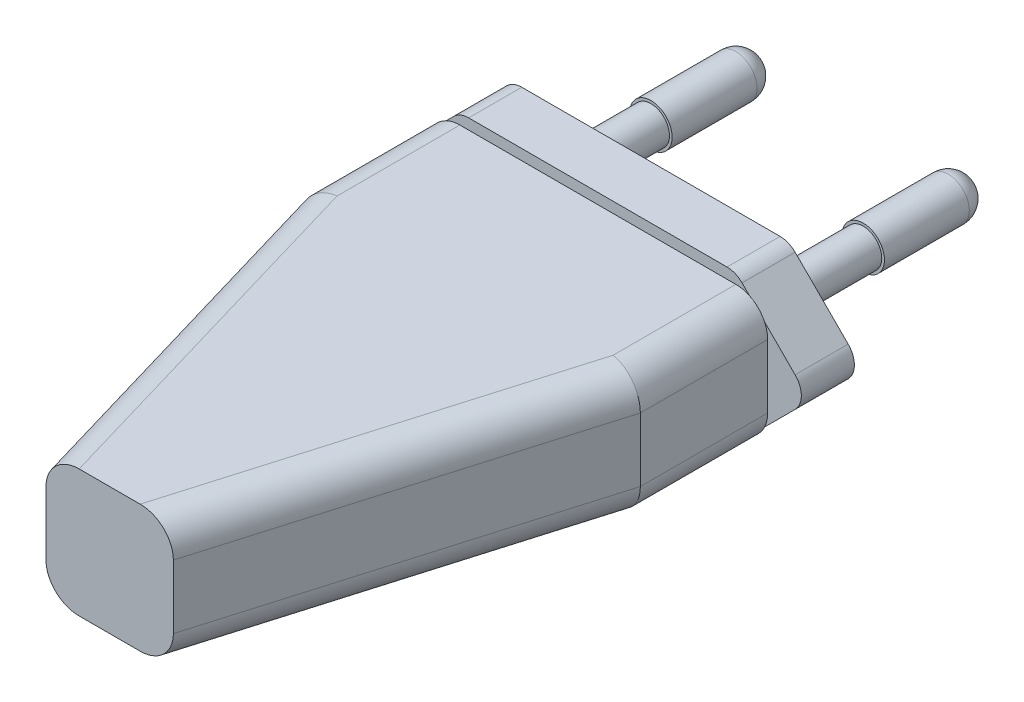
ISO-10303-21;
HEADER;
FILE_DESCRIPTION(('STEP AP214'),'2;1');
FILE_NAME('part.step','',(''),(''),'','','');
FILE_SCHEMA(('AUTOMOTIVE_DESIGN { 1 0 10303 214 1 1 1 1 }'));
ENDSEC;
DATA;
#1=APPLICATION_CONTEXT('core data for automotive mechanical design processes');
#2=APPLICATION_PROTOCOL_DEFINITION('international standard','automotive_design',2000,#1);
#3=PRODUCT_CONTEXT('',#1,'mechanical');
#4=PRODUCT('Part','Part','',(#3));
#5=PRODUCT_RELATED_PRODUCT_CATEGORY('part','',(#4));
#6=PRODUCT_DEFINITION_FORMATION('','',#4);
#7=PRODUCT_DEFINITION_CONTEXT('part definition',#1,'design');
#8=PRODUCT_DEFINITION('design','',#6,#7);
#9=PRODUCT_DEFINITION_SHAPE('','',#8);
#10=(LENGTH_UNIT() NAMED_UNIT(*) SI_UNIT(.MILLI.,.METRE.));
#11=(NAMED_UNIT(*) PLANE_ANGLE_UNIT() SI_UNIT($,.RADIAN.));
#12=(NAMED_UNIT(*) SI_UNIT($,.STERADIAN.) SOLID_ANGLE_UNIT());
#13=UNCERTAINTY_MEASURE_WITH_UNIT(LENGTH_MEASURE(1.E-05),#10,'distance_accuracy_value','');
#14=(GEOMETRIC_REPRESENTATION_CONTEXT(3) GLOBAL_UNCERTAINTY_ASSIGNED_CONTEXT((#13)) GLOBAL_UNIT_ASSIGNED_CONTEXT((#10,
#11,#12)) REPRESENTATION_CONTEXT('',''));
#15=CARTESIAN_POINT('',(0.,0.,0.));
#16=DIRECTION('',(0.,0.,1.));
#17=DIRECTION('',(1.,0.,0.));
#18=AXIS2_PLACEMENT_3D('',#15,#16,#17);
#19=CARTESIAN_POINT('',(16.,12.,-46.));
#20=DIRECTION('',(0.,0.,1.));
#21=DIRECTION('',(1.,0.,0.));
#22=AXIS2_PLACEMENT_3D('',#19,#20,#21);
#23=PLANE('',#22);
#24=DIRECTION('',(0.707106781186547,-0.707106781186548,0.));
#25=VECTOR('',#24,1.);
#26=CARTESIAN_POINT('',(20.,6.,-46.));
#27=LINE('',#26,#25);
#28=CARTESIAN_POINT('',(14.2928932188135,11.7071067811865,-46.));
#29=VERTEX_POINT('',#28);
#30=CARTESIAN_POINT('',(15.7071067811866,10.2928932188134,-46.));
#31=VERTEX_POINT('',#30);
#32=EDGE_CURVE('E371',#29,#31,#27,.T.);
#33=ORIENTED_EDGE('',*,*,#32,.F.);
#34=CARTESIAN_POINT('',(13.,9.,-46.));
#35=DIRECTION('',(0.,0.,1.));
#36=DIRECTION('',(1.,0.,0.));
#37=AXIS2_PLACEMENT_3D('',#34,#35,#36);
#38=CIRCLE('',#37,3.);
#39=EDGE_CURVE('E330',#29,#31,#38,.F.);
#40=ORIENTED_EDGE('',*,*,#39,.T.);
#41=EDGE_LOOP('',(#33,#40));
#42=FACE_BOUND('',#41,.T.);
#43=ADVANCED_FACE('F33',(#42),#23,.F.);
#44=DIRECTION('',(0.707106781186547,0.707106781186548,0.));
#45=VECTOR('',#44,1.);
#46=CARTESIAN_POINT('',(-13.,13.,-46.));
#47=LINE('',#46,#45);
#48=CARTESIAN_POINT('',(-15.7071067811865,10.2928932188134,-46.));
#49=VERTEX_POINT('',#48);
#50=CARTESIAN_POINT('',(-14.2928932188134,11.7071067811865,-46.));
#51=VERTEX_POINT('',#50);
#52=EDGE_CURVE('E255',#49,#51,#47,.T.);
#53=ORIENTED_EDGE('',*,*,#52,.F.);
#54=CARTESIAN_POINT('',(-13.,9.,-46.));
#55=DIRECTION('',(0.,0.,1.));
#56=DIRECTION('',(1.,0.,0.));
#57=AXIS2_PLACEMENT_3D('',#54,#55,#56);
#58=CIRCLE('',#57,3.);
#59=EDGE_CURVE('E337',#49,#51,#58,.F.);
#60=ORIENTED_EDGE('',*,*,#59,.T.);
#61=EDGE_LOOP('',(#53,#60));
#62=FACE_BOUND('',#61,.T.);
#63=ADVANCED_FACE('F442',(#62),#23,.F.);
#64=DIRECTION('',(-0.707106781186547,0.707106781186548,0.));
#65=VECTOR('',#64,1.);
#66=CARTESIAN_POINT('',(-20.,6.,-46.));
#67=LINE('',#66,#65);
#68=CARTESIAN_POINT('',(-14.2928932188134,0.292893218813449,-46.));
#69=VERTEX_POINT('',#68);
#70=CARTESIAN_POINT('',(-15.7071067811865,1.70710678118655,-46.));
#71=VERTEX_POINT('',#70);
#72=EDGE_CURVE('E252',#69,#71,#67,.T.);
#73=ORIENTED_EDGE('',*,*,#72,.F.);
#74=CARTESIAN_POINT('',(-13.,3.,-46.));
#75=DIRECTION('',(0.,0.,1.));
#76=DIRECTION('',(1.,0.,0.));
#77=AXIS2_PLACEMENT_3D('',#74,#75,#76);
#78=CIRCLE('',#77,3.);
#79=EDGE_CURVE('E342',#69,#71,#78,.F.);
#80=ORIENTED_EDGE('',*,*,#79,.T.);
#81=EDGE_LOOP('',(#73,#80));
#82=FACE_BOUND('',#81,.T.);
#83=ADVANCED_FACE('F448',(#82),#23,.F.);
#84=DIRECTION('',(-0.707106781186547,-0.707106781186547,0.));
#85=VECTOR('',#84,1.);
#86=CARTESIAN_POINT('',(13.,-1.,-46.));
#87=LINE('',#86,#85);
#88=CARTESIAN_POINT('',(15.7071067811866,1.70710678118655,-46.));
#89=VERTEX_POINT('',#88);
#90=CARTESIAN_POINT('',(14.2928932188135,0.292893218813449,-46.));
#91=VERTEX_POINT('',#90);
#92=EDGE_CURVE('E223',#89,#91,#87,.T.);
#93=ORIENTED_EDGE('',*,*,#92,.F.);
#94=CARTESIAN_POINT('',(13.,3.,-46.));
#95=DIRECTION('',(0.,0.,1.));
#96=DIRECTION('',(1.,0.,0.));
#97=AXIS2_PLACEMENT_3D('',#94,#95,#96);
#98=CIRCLE('',#97,3.);
#99=EDGE_CURVE('E219',#89,#91,#98,.F.);
#100=ORIENTED_EDGE('',*,*,#99,.T.);
#101=EDGE_LOOP('',(#93,#100));
#102=FACE_BOUND('',#101,.T.);
#103=ADVANCED_FACE('F221',(#102),#23,.F.);
#104=CARTESIAN_POINT('',(-6.,12.,0.));
#105=DIRECTION('',(0.,0.,-1.));
#106=DIRECTION('',(-1.,0.,0.));
#107=AXIS2_PLACEMENT_3D('',#104,#105,#106);
#108=PLANE('',#107);
#109=DIRECTION('',(0.,-1.,0.));
#110=VECTOR('',#109,1.);
#111=CARTESIAN_POINT('',(-6.,12.,0.));
#112=LINE('',#111,#110);
#113=CARTESIAN_POINT('',(-6.,9.,0.));
#114=VERTEX_POINT('',#113);
#115=CARTESIAN_POINT('',(-6.,3.,0.));
#116=VERTEX_POINT('',#115);
#117=EDGE_CURVE('E301',#114,#116,#112,.T.);
#118=ORIENTED_EDGE('',*,*,#117,.T.);
#119=CARTESIAN_POINT('',(-2.8729332094113,3.,0.));
#120=DIRECTION('',(0.,0.,-1.));
#121=DIRECTION('',(1.,0.,0.));
#122=AXIS2_PLACEMENT_3D('',#119,#120,#121);
#123=ELLIPSE('',#122,3.12706679058871,3.);
#124=CARTESIAN_POINT('',(-2.8729332094113,0.,0.));
#125=VERTEX_POINT('',#124);
#126=EDGE_CURVE('E315',#116,#125,#123,.F.);
#127=ORIENTED_EDGE('',*,*,#126,.T.);
#128=DIRECTION('',(1.,0.,0.));
#129=VECTOR('',#128,1.);
#130=CARTESIAN_POINT('',(-6.,0.,0.));
#131=LINE('',#130,#129);
#132=CARTESIAN_POINT('',(2.8729332094113,0.,0.));
#133=VERTEX_POINT('',#132);
#134=EDGE_CURVE('E283',#125,#133,#131,.T.);
#135=ORIENTED_EDGE('',*,*,#134,.T.);
#136=CARTESIAN_POINT('',(2.8729332094113,3.,0.));
#137=DIRECTION('',(0.,0.,-1.));
#138=DIRECTION('',(1.,0.,0.));
#139=AXIS2_PLACEMENT_3D('',#136,#137,#138);
#140=ELLIPSE('',#139,3.12706679058871,3.);
#141=CARTESIAN_POINT('',(6.,3.,0.));
#142=VERTEX_POINT('',#141);
#143=EDGE_CURVE('E311',#133,#142,#140,.F.);
#144=ORIENTED_EDGE('',*,*,#143,.T.);
#145=DIRECTION('',(0.,-1.,0.));
#146=VECTOR('',#145,1.);
#147=CARTESIAN_POINT('',(6.,12.,0.));
#148=LINE('',#147,#146);
#149=CARTESIAN_POINT('',(6.,9.,0.));
#150=VERTEX_POINT('',#149);
#151=EDGE_CURVE('E298',#150,#142,#148,.T.);
#152=ORIENTED_EDGE('',*,*,#151,.F.);
#153=CARTESIAN_POINT('',(2.8729332094113,9.,0.));
#154=DIRECTION('',(0.,0.,-1.));
#155=DIRECTION('',(-1.,0.,0.));
#156=AXIS2_PLACEMENT_3D('',#153,#154,#155);
#157=ELLIPSE('',#156,3.12706679058871,3.);
#158=CARTESIAN_POINT('',(2.8729332094113,12.,0.));
#159=VERTEX_POINT('',#158);
#160=EDGE_CURVE('E309',#150,#159,#157,.F.);
#161=ORIENTED_EDGE('',*,*,#160,.T.);
#162=DIRECTION('',(1.,0.,0.));
#163=VECTOR('',#162,1.);
#164=CARTESIAN_POINT('',(-6.,12.,0.));
#165=LINE('',#164,#163);
#166=CARTESIAN_POINT('',(-2.8729332094113,12.,0.));
#167=VERTEX_POINT('',#166);
#168=EDGE_CURVE('E276',#167,#159,#165,.T.);
#169=ORIENTED_EDGE('',*,*,#168,.F.);
#170=CARTESIAN_POINT('',(-2.8729332094113,9.,0.));
#171=DIRECTION('',(0.,0.,-1.));
#172=DIRECTION('',(-1.,0.,0.));
#173=AXIS2_PLACEMENT_3D('',#170,#171,#172);
#174=ELLIPSE('',#173,3.12706679058871,3.);
#175=EDGE_CURVE('E313',#167,#114,#174,.F.);
#176=ORIENTED_EDGE('',*,*,#175,.T.);
#177=EDGE_LOOP('',(#118,#127,#135,#144,#152,#161,#169,#176));
#178=FACE_BOUND('',#177,.T.);
#179=ADVANCED_FACE('F454',(#178),#108,.F.);
#180=CARTESIAN_POINT('',(11.,12.,-17.));
#181=DIRECTION('',(-0.95936550157127,0.,-0.28216632399155));
#182=DIRECTION('',(-0.28216632399155,0.,0.959365501571271));
#183=AXIS2_PLACEMENT_3D('',#180,#181,#182);
#184=PLANE('',#183);
#185=ORIENTED_EDGE('',*,*,#151,.T.);
#186=DIRECTION('',(0.28216632399155,0.,-0.959365501571271));
#187=VECTOR('',#186,1.);
#188=CARTESIAN_POINT('',(11.,3.,-17.));
#189=LINE('',#188,#187);
#190=CARTESIAN_POINT('',(16.,3.,-34.));
#191=VERTEX_POINT('',#190);
#192=EDGE_CURVE('E354',#142,#191,#189,.T.);
#193=ORIENTED_EDGE('',*,*,#192,.T.);
#194=DIRECTION('',(0.,-1.,0.));
#195=VECTOR('',#194,1.);
#196=CARTESIAN_POINT('',(16.,12.,-34.));
#197=LINE('',#196,#195);
#198=CARTESIAN_POINT('',(16.,9.,-34.));
#199=VERTEX_POINT('',#198);
#200=EDGE_CURVE('E295',#199,#191,#197,.T.);
#201=ORIENTED_EDGE('',*,*,#200,.F.);
#202=DIRECTION('',(0.28216632399155,0.,-0.959365501571271));
#203=VECTOR('',#202,1.);
#204=CARTESIAN_POINT('',(6.00000000000001,9.,0.));
#205=LINE('',#204,#203);
#206=EDGE_CURVE('E352',#199,#150,#205,.F.);
#207=ORIENTED_EDGE('',*,*,#206,.T.);
#208=EDGE_LOOP('',(#185,#193,#201,#207));
#209=FACE_BOUND('',#208,.T.);
#210=ADVANCED_FACE('F459',(#209),#184,.F.);
#211=CARTESIAN_POINT('',(16.,12.,-34.));
#212=DIRECTION('',(-1.,0.,0.));
#213=DIRECTION('',(0.,0.,1.));
#214=AXIS2_PLACEMENT_3D('',#211,#212,#213);
#215=PLANE('',#214);
#216=ORIENTED_EDGE('',*,*,#200,.T.);
#217=DIRECTION('',(0.,0.,-1.));
#218=VECTOR('',#217,1.);
#219=CARTESIAN_POINT('',(16.,3.,-34.));
#220=LINE('',#219,#218);
#221=CARTESIAN_POINT('',(16.,3.,-46.));
#222=VERTEX_POINT('',#221);
#223=EDGE_CURVE('E253',#191,#222,#220,.T.);
#224=ORIENTED_EDGE('',*,*,#223,.T.);
#225=DIRECTION('',(0.,-1.,0.));
#226=VECTOR('',#225,1.);
#227=CARTESIAN_POINT('',(16.,12.,-46.));
#228=LINE('',#227,#226);
#229=CARTESIAN_POINT('',(16.,9.,-46.));
#230=VERTEX_POINT('',#229);
#231=EDGE_CURVE('E292',#230,#222,#228,.T.);
#232=ORIENTED_EDGE('',*,*,#231,.F.);
#233=DIRECTION('',(0.,0.,-1.));
#234=VECTOR('',#233,1.);
#235=CARTESIAN_POINT('',(16.,9.,-34.));
#236=LINE('',#235,#234);
#237=EDGE_CURVE('E259',#230,#199,#236,.F.);
#238=ORIENTED_EDGE('',*,*,#237,.T.);
#239=EDGE_LOOP('',(#216,#224,#232,#238));
#240=FACE_BOUND('',#239,.T.);
#241=ADVANCED_FACE('F593',(#240),#215,.F.);
#242=CARTESIAN_POINT('',(-16.,12.,-34.));
#243=DIRECTION('',(1.,0.,0.));
#244=DIRECTION('',(0.,0.,-1.));
#245=AXIS2_PLACEMENT_3D('',#242,#243,#244);
#246=PLANE('',#245);
#247=DIRECTION('',(0.,-1.,0.));
#248=VECTOR('',#247,1.);
#249=CARTESIAN_POINT('',(-16.,12.,-46.));
#250=LINE('',#249,#248);
#251=CARTESIAN_POINT('',(-16.,9.,-46.));
#252=VERTEX_POINT('',#251);
#253=CARTESIAN_POINT('',(-16.,3.,-46.));
#254=VERTEX_POINT('',#253);
#255=EDGE_CURVE('E290',#252,#254,#250,.T.);
#256=ORIENTED_EDGE('',*,*,#255,.T.);
#257=DIRECTION('',(0.,0.,1.));
#258=VECTOR('',#257,1.);
#259=CARTESIAN_POINT('',(-16.,3.,-34.));
#260=LINE('',#259,#258);
#261=CARTESIAN_POINT('',(-16.,3.,-34.));
#262=VERTEX_POINT('',#261);
#263=EDGE_CURVE('E326',#254,#262,#260,.T.);
#264=ORIENTED_EDGE('',*,*,#263,.T.);
#265=DIRECTION('',(0.,-1.,0.));
#266=VECTOR('',#265,1.);
#267=CARTESIAN_POINT('',(-16.,12.,-34.));
#268=LINE('',#267,#266);
#269=CARTESIAN_POINT('',(-16.,9.,-34.));
#270=VERTEX_POINT('',#269);
#271=EDGE_CURVE('E282',#270,#262,#268,.T.);
#272=ORIENTED_EDGE('',*,*,#271,.F.);
#273=DIRECTION('',(0.,0.,1.));
#274=VECTOR('',#273,1.);
#275=CARTESIAN_POINT('',(-16.,9.,-46.));
#276=LINE('',#275,#274);
#277=EDGE_CURVE('E324',#270,#252,#276,.F.);
#278=ORIENTED_EDGE('',*,*,#277,.T.);
#279=EDGE_LOOP('',(#256,#264,#272,#278));
#280=FACE_BOUND('',#279,.T.);
#281=ADVANCED_FACE('F498',(#280),#246,.F.);
#282=CARTESIAN_POINT('',(-11.,12.,-17.));
#283=DIRECTION('',(0.95936550157127,0.,-0.28216632399155));
#284=DIRECTION('',(-0.28216632399155,0.,-0.959365501571271));
#285=AXIS2_PLACEMENT_3D('',#282,#283,#284);
#286=PLANE('',#285);
#287=ORIENTED_EDGE('',*,*,#271,.T.);
#288=DIRECTION('',(0.28216632399155,0.,0.959365501571271));
#289=VECTOR('',#288,1.);
#290=CARTESIAN_POINT('',(-11.,3.,-17.));
#291=LINE('',#290,#289);
#292=EDGE_CURVE('E306',#262,#116,#291,.T.);
#293=ORIENTED_EDGE('',*,*,#292,.T.);
#294=ORIENTED_EDGE('',*,*,#117,.F.);
#295=DIRECTION('',(0.28216632399155,0.,0.959365501571271));
#296=VECTOR('',#295,1.);
#297=CARTESIAN_POINT('',(-16.,9.,-34.));
#298=LINE('',#297,#296);
#299=EDGE_CURVE('E304',#114,#270,#298,.F.);
#300=ORIENTED_EDGE('',*,*,#299,.T.);
#301=EDGE_LOOP('',(#287,#293,#294,#300));
#302=FACE_BOUND('',#301,.T.);
#303=ADVANCED_FACE('F487',(#302),#286,.F.);
#304=CARTESIAN_POINT('',(0.,12.,0.));
#305=DIRECTION('',(0.,1.,0.));
#306=DIRECTION('',(0.,0.,1.));
#307=AXIS2_PLACEMENT_3D('',#304,#305,#306);
#308=PLANE('',#307);
#309=DIRECTION('',(-1.,0.,0.));
#310=VECTOR('',#309,1.);
#311=CARTESIAN_POINT('',(16.,12.,-46.));
#312=LINE('',#311,#310);
#313=CARTESIAN_POINT('',(13.,12.,-46.));
#314=VERTEX_POINT('',#313);
#315=CARTESIAN_POINT('',(-13.,12.,-46.));
#316=VERTEX_POINT('',#315);
#317=EDGE_CURVE('E279',#314,#316,#312,.T.);
#318=ORIENTED_EDGE('',*,*,#317,.T.);
#319=DIRECTION('',(0.,0.,1.));
#320=VECTOR('',#319,1.);
#321=CARTESIAN_POINT('',(-13.,12.,-34.));
#322=LINE('',#321,#320);
#323=CARTESIAN_POINT('',(-13.,12.,-34.4320270880016));
#324=VERTEX_POINT('',#323);
#325=EDGE_CURVE('E349',#316,#324,#322,.T.);
#326=ORIENTED_EDGE('',*,*,#325,.T.);
#327=DIRECTION('',(0.28216632399155,0.,0.959365501571271));
#328=VECTOR('',#327,1.);
#329=CARTESIAN_POINT('',(-3.12190349528619,12.,-0.846498971974649));
#330=LINE('',#329,#328);
#331=EDGE_CURVE('E347',#324,#167,#330,.T.);
#332=ORIENTED_EDGE('',*,*,#331,.T.);
#333=ORIENTED_EDGE('',*,*,#168,.T.);
#334=DIRECTION('',(0.28216632399155,0.,-0.959365501571271));
#335=VECTOR('',#334,1.);
#336=CARTESIAN_POINT('',(13.1219034952862,12.,-34.8464989719747));
#337=LINE('',#336,#335);
#338=CARTESIAN_POINT('',(13.,12.,-34.4320270880016));
#339=VERTEX_POINT('',#338);
#340=EDGE_CURVE('E341',#159,#339,#337,.T.);
#341=ORIENTED_EDGE('',*,*,#340,.T.);
#342=DIRECTION('',(0.,0.,-1.));
#343=VECTOR('',#342,1.);
#344=CARTESIAN_POINT('',(13.,12.,-46.));
#345=LINE('',#344,#343);
#346=EDGE_CURVE('E344',#339,#314,#345,.T.);
#347=ORIENTED_EDGE('',*,*,#346,.T.);
#348=EDGE_LOOP('',(#318,#326,#332,#333,#341,#347));
#349=FACE_BOUND('',#348,.T.);
#350=ADVANCED_FACE('F585',(#349),#308,.T.);
#351=CARTESIAN_POINT('',(0.,0.,0.));
#352=DIRECTION('',(0.,1.,0.));
#353=DIRECTION('',(0.,0.,1.));
#354=AXIS2_PLACEMENT_3D('',#351,#352,#353);
#355=PLANE('',#354);
#356=ORIENTED_EDGE('',*,*,#134,.F.);
#357=DIRECTION('',(0.28216632399155,0.,0.959365501571271));
#358=VECTOR('',#357,1.);
#359=CARTESIAN_POINT('',(-2.64419648891677,0.,0.777704849681402));
#360=LINE('',#359,#358);
#361=CARTESIAN_POINT('',(-13.,0.,-34.4320270880016));
#362=VERTEX_POINT('',#361);
#363=EDGE_CURVE('E322',#125,#362,#360,.F.);
#364=ORIENTED_EDGE('',*,*,#363,.T.);
#365=DIRECTION('',(0.,0.,1.));
#366=VECTOR('',#365,1.);
#367=CARTESIAN_POINT('',(-13.,0.,0.));
#368=LINE('',#367,#366);
#369=CARTESIAN_POINT('',(-13.,0.,-46.));
#370=VERTEX_POINT('',#369);
#371=EDGE_CURVE('E320',#362,#370,#368,.F.);
#372=ORIENTED_EDGE('',*,*,#371,.T.);
#373=DIRECTION('',(-1.,0.,0.));
#374=VECTOR('',#373,1.);
#375=CARTESIAN_POINT('',(16.,0.,-46.));
#376=LINE('',#375,#374);
#377=CARTESIAN_POINT('',(13.,0.,-46.));
#378=VERTEX_POINT('',#377);
#379=EDGE_CURVE('E280',#378,#370,#376,.T.);
#380=ORIENTED_EDGE('',*,*,#379,.F.);
#381=DIRECTION('',(0.,0.,-1.));
#382=VECTOR('',#381,1.);
#383=CARTESIAN_POINT('',(13.,0.,0.));
#384=LINE('',#383,#382);
#385=CARTESIAN_POINT('',(13.,0.,-34.4320270880016));
#386=VERTEX_POINT('',#385);
#387=EDGE_CURVE('E235',#378,#386,#384,.F.);
#388=ORIENTED_EDGE('',*,*,#387,.T.);
#389=DIRECTION('',(0.28216632399155,0.,-0.959365501571271));
#390=VECTOR('',#389,1.);
#391=CARTESIAN_POINT('',(2.64419648891677,0.,0.777704849681402));
#392=LINE('',#391,#390);
#393=EDGE_CURVE('E318',#386,#133,#392,.F.);
#394=ORIENTED_EDGE('',*,*,#393,.T.);
#395=EDGE_LOOP('',(#356,#364,#372,#380,#388,#394));
#396=FACE_BOUND('',#395,.T.);
#397=ADVANCED_FACE('F478',(#396),#355,.F.);
#398=CARTESIAN_POINT('',(-13.,3.,-34.));
#399=DIRECTION('',(0.,0.,1.));
#400=DIRECTION('',(1.,0.,0.));
#401=AXIS2_PLACEMENT_3D('',#398,#399,#400);
#402=CYLINDRICAL_SURFACE('',#401,3.);
#403=EDGE_CURVE('E338',#370,#69,#78,.F.);
#404=ORIENTED_EDGE('',*,*,#403,.F.);
#405=ORIENTED_EDGE('',*,*,#371,.F.);
#406=CARTESIAN_POINT('',(-13.,3.,-34.4320270880017));
#407=DIRECTION('',(0.142538588509795,0.,0.989789245640523));
#408=DIRECTION('',(-0.989789245640523,0.,0.142538588509795));
#409=AXIS2_PLACEMENT_3D('',#406,#407,#408);
#410=ELLIPSE('',#409,3.03094826824332,3.);
#411=EDGE_CURVE('E286',#262,#362,#410,.T.);
#412=ORIENTED_EDGE('',*,*,#411,.F.);
#413=ORIENTED_EDGE('',*,*,#263,.F.);
#414=EDGE_CURVE('E336',#71,#254,#78,.F.);
#415=ORIENTED_EDGE('',*,*,#414,.F.);
#416=ORIENTED_EDGE('',*,*,#79,.F.);
#417=EDGE_LOOP('',(#404,#405,#412,#413,#415,#416));
#418=FACE_BOUND('',#417,.T.);
#419=ADVANCED_FACE('F471',(#418),#402,.T.);
#420=CARTESIAN_POINT('',(-8.12190349528619,3.,-17.8464989719747));
#421=DIRECTION('',(0.28216632399155,0.,0.959365501571271));
#422=DIRECTION('',(0.959365501571271,0.,-0.28216632399155));
#423=AXIS2_PLACEMENT_3D('',#420,#421,#422);
#424=CYLINDRICAL_SURFACE('',#423,3.);
#425=ORIENTED_EDGE('',*,*,#411,.T.);
#426=ORIENTED_EDGE('',*,*,#363,.F.);
#427=ORIENTED_EDGE('',*,*,#126,.F.);
#428=ORIENTED_EDGE('',*,*,#292,.F.);
#429=EDGE_LOOP('',(#425,#426,#427,#428));
#430=FACE_BOUND('',#429,.T.);
#431=ADVANCED_FACE('F484',(#430),#424,.T.);
#432=CARTESIAN_POINT('',(-2.64419648891677,9.,0.777704849681401));
#433=DIRECTION('',(-0.28216632399155,0.,-0.959365501571271));
#434=DIRECTION('',(-0.959365501571271,0.,0.28216632399155));
#435=AXIS2_PLACEMENT_3D('',#432,#433,#434);
#436=CYLINDRICAL_SURFACE('',#435,3.);
#437=ORIENTED_EDGE('',*,*,#175,.F.);
#438=ORIENTED_EDGE('',*,*,#331,.F.);
#439=CARTESIAN_POINT('',(-13.,9.,-34.4320270880016));
#440=DIRECTION('',(-0.142538588509795,0.,-0.989789245640523));
#441=DIRECTION('',(-0.989789245640523,0.,0.142538588509795));
#442=AXIS2_PLACEMENT_3D('',#439,#440,#441);
#443=ELLIPSE('',#442,3.03094826824332,3.);
#444=EDGE_CURVE('E360',#270,#324,#443,.T.);
#445=ORIENTED_EDGE('',*,*,#444,.F.);
#446=ORIENTED_EDGE('',*,*,#299,.F.);
#447=EDGE_LOOP('',(#437,#438,#445,#446));
#448=FACE_BOUND('',#447,.T.);
#449=ADVANCED_FACE('F494',(#448),#436,.T.);
#450=CARTESIAN_POINT('',(-13.,9.,0.));
#451=DIRECTION('',(0.,0.,-1.));
#452=DIRECTION('',(-1.,0.,0.));
#453=AXIS2_PLACEMENT_3D('',#450,#451,#452);
#454=CYLINDRICAL_SURFACE('',#453,3.);
#455=EDGE_CURVE('E333',#252,#49,#58,.F.);
#456=ORIENTED_EDGE('',*,*,#455,.F.);
#457=ORIENTED_EDGE('',*,*,#277,.F.);
#458=ORIENTED_EDGE('',*,*,#444,.T.);
#459=ORIENTED_EDGE('',*,*,#325,.F.);
#460=EDGE_CURVE('E332',#51,#316,#58,.F.);
#461=ORIENTED_EDGE('',*,*,#460,.F.);
#462=ORIENTED_EDGE('',*,*,#59,.F.);
#463=EDGE_LOOP('',(#456,#457,#458,#459,#461,#462));
#464=FACE_BOUND('',#463,.T.);
#465=ADVANCED_FACE('F501',(#464),#454,.T.);
#466=CARTESIAN_POINT('',(13.,3.,-34.));
#467=DIRECTION('',(0.,0.,-1.));
#468=DIRECTION('',(-1.,0.,0.));
#469=AXIS2_PLACEMENT_3D('',#466,#467,#468);
#470=CYLINDRICAL_SURFACE('',#469,3.);
#471=EDGE_CURVE('E227',#222,#89,#98,.F.);
#472=ORIENTED_EDGE('',*,*,#471,.F.);
#473=ORIENTED_EDGE('',*,*,#223,.F.);
#474=CARTESIAN_POINT('',(13.,3.,-34.4320270880017));
#475=DIRECTION('',(0.142538588509795,0.,-0.989789245640523));
#476=DIRECTION('',(-0.989789245640523,0.,-0.142538588509795));
#477=AXIS2_PLACEMENT_3D('',#474,#475,#476);
#478=ELLIPSE('',#477,3.03094826824332,3.);
#479=EDGE_CURVE('E362',#386,#191,#478,.F.);
#480=ORIENTED_EDGE('',*,*,#479,.F.);
#481=ORIENTED_EDGE('',*,*,#387,.F.);
#482=EDGE_CURVE('E228',#91,#378,#98,.F.);
#483=ORIENTED_EDGE('',*,*,#482,.F.);
#484=ORIENTED_EDGE('',*,*,#99,.F.);
#485=EDGE_LOOP('',(#472,#473,#480,#481,#483,#484));
#486=FACE_BOUND('',#485,.T.);
#487=ADVANCED_FACE('F233',(#486),#470,.T.);
#488=CARTESIAN_POINT('',(8.12190349528619,3.,-17.8464989719747));
#489=DIRECTION('',(0.28216632399155,0.,-0.959365501571271));
#490=DIRECTION('',(-0.959365501571271,0.,-0.28216632399155));
#491=AXIS2_PLACEMENT_3D('',#488,#489,#490);
#492=CYLINDRICAL_SURFACE('',#491,3.);
#493=ORIENTED_EDGE('',*,*,#143,.F.);
#494=ORIENTED_EDGE('',*,*,#393,.F.);
#495=ORIENTED_EDGE('',*,*,#479,.T.);
#496=ORIENTED_EDGE('',*,*,#192,.F.);
#497=EDGE_LOOP('',(#493,#494,#495,#496));
#498=FACE_BOUND('',#497,.T.);
#499=ADVANCED_FACE('F612',(#498),#492,.T.);
#500=CARTESIAN_POINT('',(2.64419648891677,9.,0.777704849681402));
#501=DIRECTION('',(-0.28216632399155,0.,0.959365501571271));
#502=DIRECTION('',(0.959365501571271,0.,0.28216632399155));
#503=AXIS2_PLACEMENT_3D('',#500,#501,#502);
#504=CYLINDRICAL_SURFACE('',#503,3.);
#505=ORIENTED_EDGE('',*,*,#160,.F.);
#506=ORIENTED_EDGE('',*,*,#206,.F.);
#507=CARTESIAN_POINT('',(13.,9.,-34.4320270880016));
#508=DIRECTION('',(-0.142538588509795,0.,0.989789245640523));
#509=DIRECTION('',(-0.989789245640523,0.,-0.142538588509795));
#510=AXIS2_PLACEMENT_3D('',#507,#508,#509);
#511=ELLIPSE('',#510,3.03094826824332,3.);
#512=EDGE_CURVE('E364',#339,#199,#511,.F.);
#513=ORIENTED_EDGE('',*,*,#512,.F.);
#514=ORIENTED_EDGE('',*,*,#340,.F.);
#515=EDGE_LOOP('',(#505,#506,#513,#514));
#516=FACE_BOUND('',#515,.T.);
#517=ADVANCED_FACE('F615',(#516),#504,.T.);
#518=CARTESIAN_POINT('',(13.,9.,0.));
#519=DIRECTION('',(0.,0.,1.));
#520=DIRECTION('',(1.,0.,0.));
#521=AXIS2_PLACEMENT_3D('',#518,#519,#520);
#522=CYLINDRICAL_SURFACE('',#521,3.);
#523=ORIENTED_EDGE('',*,*,#512,.T.);
#524=ORIENTED_EDGE('',*,*,#237,.F.);
#525=EDGE_CURVE('E328',#31,#230,#38,.F.);
#526=ORIENTED_EDGE('',*,*,#525,.F.);
#527=ORIENTED_EDGE('',*,*,#39,.F.);
#528=EDGE_CURVE('E238',#314,#29,#38,.F.);
#529=ORIENTED_EDGE('',*,*,#528,.F.);
#530=ORIENTED_EDGE('',*,*,#346,.F.);
#531=EDGE_LOOP('',(#523,#524,#526,#527,#529,#530));
#532=FACE_BOUND('',#531,.T.);
#533=ADVANCED_FACE('F619',(#532),#522,.T.);
#534=CARTESIAN_POINT('',(0.,0.,-46.));
#535=DIRECTION('',(0.,0.,1.));
#536=DIRECTION('',(1.,0.,0.));
#537=AXIS2_PLACEMENT_3D('',#534,#535,#536);
#538=PLANE('',#537);
#539=CARTESIAN_POINT('',(-18.5857864376269,7.4142135623731,-46.));
#540=VERTEX_POINT('',#539);
#541=EDGE_CURVE('E270',#540,#49,#47,.T.);
#542=ORIENTED_EDGE('',*,*,#541,.F.);
#543=CARTESIAN_POINT('',(-17.1715728752538,6.,-46.));
#544=DIRECTION('',(0.,0.,1.));
#545=DIRECTION('',(1.,0.,0.));
#546=AXIS2_PLACEMENT_3D('',#543,#544,#545);
#547=CIRCLE('',#546,2.);
#548=CARTESIAN_POINT('',(-18.5857864376269,4.58578643762691,-46.));
#549=VERTEX_POINT('',#548);
#550=EDGE_CURVE('E48',#540,#549,#547,.T.);
#551=ORIENTED_EDGE('',*,*,#550,.T.);
#552=EDGE_CURVE('E258',#71,#549,#67,.T.);
#553=ORIENTED_EDGE('',*,*,#552,.F.);
#554=ORIENTED_EDGE('',*,*,#414,.T.);
#555=ORIENTED_EDGE('',*,*,#255,.F.);
#556=ORIENTED_EDGE('',*,*,#455,.T.);
#557=EDGE_LOOP('',(#542,#551,#553,#554,#555,#556));
#558=FACE_BOUND('',#557,.T.);
#559=ADVANCED_FACE('F506',(#558),#538,.T.);
#560=CARTESIAN_POINT('',(13.5857864376269,12.4142135623731,-46.));
#561=VERTEX_POINT('',#560);
#562=EDGE_CURVE('E247',#561,#29,#27,.T.);
#563=ORIENTED_EDGE('',*,*,#562,.F.);
#564=CARTESIAN_POINT('',(12.1715728752538,11.,-46.));
#565=DIRECTION('',(0.,0.,1.));
#566=DIRECTION('',(1.,0.,0.));
#567=AXIS2_PLACEMENT_3D('',#564,#565,#566);
#568=CIRCLE('',#567,2.);
#569=CARTESIAN_POINT('',(12.1715728752538,13.,-46.));
#570=VERTEX_POINT('',#569);
#571=EDGE_CURVE('E401',#561,#570,#568,.T.);
#572=ORIENTED_EDGE('',*,*,#571,.T.);
#573=DIRECTION('',(1.,0.,0.));
#574=VECTOR('',#573,1.);
#575=CARTESIAN_POINT('',(13.,13.,-46.));
#576=LINE('',#575,#574);
#577=CARTESIAN_POINT('',(-12.1715728752538,13.,-46.));
#578=VERTEX_POINT('',#577);
#579=EDGE_CURVE('E272',#578,#570,#576,.T.);
#580=ORIENTED_EDGE('',*,*,#579,.F.);
#581=CARTESIAN_POINT('',(-12.1715728752538,11.,-46.));
#582=DIRECTION('',(0.,0.,1.));
#583=DIRECTION('',(1.,0.,0.));
#584=AXIS2_PLACEMENT_3D('',#581,#582,#583);
#585=CIRCLE('',#584,2.);
#586=CARTESIAN_POINT('',(-13.5857864376269,12.4142135623731,-46.));
#587=VERTEX_POINT('',#586);
#588=EDGE_CURVE('E399',#578,#587,#585,.T.);
#589=ORIENTED_EDGE('',*,*,#588,.T.);
#590=EDGE_CURVE('E269',#51,#587,#47,.T.);
#591=ORIENTED_EDGE('',*,*,#590,.F.);
#592=ORIENTED_EDGE('',*,*,#460,.T.);
#593=ORIENTED_EDGE('',*,*,#317,.F.);
#594=ORIENTED_EDGE('',*,*,#528,.T.);
#595=EDGE_LOOP('',(#563,#572,#580,#589,#591,#592,#593,#594));
#596=FACE_BOUND('',#595,.T.);
#597=ADVANCED_FACE('F819',(#596),#538,.T.);
#598=CARTESIAN_POINT('',(18.5857864376269,4.5857864376269,-46.));
#599=VERTEX_POINT('',#598);
#600=EDGE_CURVE('E246',#599,#89,#87,.T.);
#601=ORIENTED_EDGE('',*,*,#600,.F.);
#602=CARTESIAN_POINT('',(17.1715728752538,6.,-46.));
#603=DIRECTION('',(0.,0.,1.));
#604=DIRECTION('',(1.,0.,0.));
#605=AXIS2_PLACEMENT_3D('',#602,#603,#604);
#606=CIRCLE('',#605,2.);
#607=CARTESIAN_POINT('',(18.5857864376269,7.41421356237309,-46.));
#608=VERTEX_POINT('',#607);
#609=EDGE_CURVE('E392',#599,#608,#606,.T.);
#610=ORIENTED_EDGE('',*,*,#609,.T.);
#611=EDGE_CURVE('E530',#31,#608,#27,.T.);
#612=ORIENTED_EDGE('',*,*,#611,.F.);
#613=ORIENTED_EDGE('',*,*,#525,.T.);
#614=ORIENTED_EDGE('',*,*,#231,.T.);
#615=ORIENTED_EDGE('',*,*,#471,.T.);
#616=EDGE_LOOP('',(#601,#610,#612,#613,#614,#615));
#617=FACE_BOUND('',#616,.T.);
#618=ADVANCED_FACE('F584',(#617),#538,.T.);
#619=CARTESIAN_POINT('',(20.,6.,-51.));
#620=DIRECTION('',(-0.707106781186548,-0.707106781186547,0.));
#621=DIRECTION('',(0.707106781186547,-0.707106781186548,0.));
#622=AXIS2_PLACEMENT_3D('',#619,#620,#621);
#623=PLANE('',#622);
#624=ORIENTED_EDGE('',*,*,#611,.T.);
#625=DIRECTION('',(0.,0.,1.));
#626=VECTOR('',#625,1.);
#627=CARTESIAN_POINT('',(18.5857864376269,7.41421356237309,-51.));
#628=LINE('',#627,#626);
#629=CARTESIAN_POINT('',(18.5857864376269,7.41421356237309,-51.));
#630=VERTEX_POINT('',#629);
#631=EDGE_CURVE('E397',#608,#630,#628,.F.);
#632=ORIENTED_EDGE('',*,*,#631,.T.);
#633=DIRECTION('',(0.707106781186547,-0.707106781186548,0.));
#634=VECTOR('',#633,1.);
#635=CARTESIAN_POINT('',(20.,6.,-51.));
#636=LINE('',#635,#634);
#637=CARTESIAN_POINT('',(13.5857864376269,12.4142135623731,-51.));
#638=VERTEX_POINT('',#637);
#639=EDGE_CURVE('E275',#638,#630,#636,.T.);
#640=ORIENTED_EDGE('',*,*,#639,.F.);
#641=DIRECTION('',(0.,0.,1.));
#642=VECTOR('',#641,1.);
#643=CARTESIAN_POINT('',(13.5857864376269,12.4142135623731,-51.));
#644=LINE('',#643,#642);
#645=EDGE_CURVE('E394',#638,#561,#644,.T.);
#646=ORIENTED_EDGE('',*,*,#645,.T.);
#647=ORIENTED_EDGE('',*,*,#562,.T.);
#648=ORIENTED_EDGE('',*,*,#32,.T.);
#649=EDGE_LOOP('',(#624,#632,#640,#646,#647,#648));
#650=FACE_BOUND('',#649,.T.);
#651=ADVANCED_FACE('F556',(#650),#623,.F.);
#652=CARTESIAN_POINT('',(13.,-1.,-51.));
#653=DIRECTION('',(-0.707106781186548,0.707106781186548,0.));
#654=DIRECTION('',(-0.707106781186548,-0.707106781186548,0.));
#655=AXIS2_PLACEMENT_3D('',#652,#653,#654);
#656=PLANE('',#655);
#657=CARTESIAN_POINT('',(13.5857864376269,-0.414213562373095,-46.));
#658=VERTEX_POINT('',#657);
#659=EDGE_CURVE('E240',#91,#658,#87,.T.);
#660=ORIENTED_EDGE('',*,*,#659,.T.);
#661=DIRECTION('',(0.,0.,1.));
#662=VECTOR('',#661,1.);
#663=CARTESIAN_POINT('',(13.5857864376269,-0.414213562373095,-51.));
#664=LINE('',#663,#662);
#665=CARTESIAN_POINT('',(13.5857864376269,-0.414213562373095,-51.));
#666=VERTEX_POINT('',#665);
#667=EDGE_CURVE('E378',#658,#666,#664,.F.);
#668=ORIENTED_EDGE('',*,*,#667,.T.);
#669=DIRECTION('',(-0.707106781186547,-0.707106781186547,0.));
#670=VECTOR('',#669,1.);
#671=CARTESIAN_POINT('',(13.,-1.,-51.));
#672=LINE('',#671,#670);
#673=CARTESIAN_POINT('',(18.5857864376269,4.5857864376269,-51.));
#674=VERTEX_POINT('',#673);
#675=EDGE_CURVE('E558',#674,#666,#672,.T.);
#676=ORIENTED_EDGE('',*,*,#675,.F.);
#677=DIRECTION('',(0.,0.,1.));
#678=VECTOR('',#677,1.);
#679=CARTESIAN_POINT('',(18.5857864376269,4.5857864376269,-51.));
#680=LINE('',#679,#678);
#681=EDGE_CURVE('E376',#674,#599,#680,.T.);
#682=ORIENTED_EDGE('',*,*,#681,.T.);
#683=ORIENTED_EDGE('',*,*,#600,.T.);
#684=ORIENTED_EDGE('',*,*,#92,.T.);
#685=EDGE_LOOP('',(#660,#668,#676,#682,#683,#684));
#686=FACE_BOUND('',#685,.T.);
#687=ADVANCED_FACE('F249',(#686),#656,.F.);
#688=CARTESIAN_POINT('',(-13.,-1.,-51.));
#689=DIRECTION('',(0.,1.,0.));
#690=DIRECTION('',(0.,0.,1.));
#691=AXIS2_PLACEMENT_3D('',#688,#689,#690);
#692=PLANE('',#691);
#693=DIRECTION('',(-1.,0.,0.));
#694=VECTOR('',#693,1.);
#695=CARTESIAN_POINT('',(-13.,-1.,-51.));
#696=LINE('',#695,#694);
#697=CARTESIAN_POINT('',(12.1715728752538,-1.,-51.));
#698=VERTEX_POINT('',#697);
#699=CARTESIAN_POINT('',(-12.1715728752538,-1.,-51.));
#700=VERTEX_POINT('',#699);
#701=EDGE_CURVE('E527',#698,#700,#696,.T.);
#702=ORIENTED_EDGE('',*,*,#701,.F.);
#703=DIRECTION('',(0.,0.,1.));
#704=VECTOR('',#703,1.);
#705=CARTESIAN_POINT('',(12.1715728752538,-1.,-51.));
#706=LINE('',#705,#704);
#707=CARTESIAN_POINT('',(12.1715728752538,-1.,-46.));
#708=VERTEX_POINT('',#707);
#709=EDGE_CURVE('E370',#698,#708,#706,.T.);
#710=ORIENTED_EDGE('',*,*,#709,.T.);
#711=DIRECTION('',(-1.,0.,0.));
#712=VECTOR('',#711,1.);
#713=CARTESIAN_POINT('',(-13.,-1.,-46.));
#714=LINE('',#713,#712);
#715=CARTESIAN_POINT('',(-12.1715728752538,-1.,-46.));
#716=VERTEX_POINT('',#715);
#717=EDGE_CURVE('E263',#708,#716,#714,.T.);
#718=ORIENTED_EDGE('',*,*,#717,.T.);
#719=DIRECTION('',(0.,0.,1.));
#720=VECTOR('',#719,1.);
#721=CARTESIAN_POINT('',(-12.1715728752538,-1.,-51.));
#722=LINE('',#721,#720);
#723=EDGE_CURVE('E368',#716,#700,#722,.F.);
#724=ORIENTED_EDGE('',*,*,#723,.T.);
#725=EDGE_LOOP('',(#702,#710,#718,#724));
#726=FACE_BOUND('',#725,.T.);
#727=ADVANCED_FACE('F571',(#726),#692,.F.);
#728=CARTESIAN_POINT('',(-20.,6.,-51.));
#729=DIRECTION('',(0.707106781186548,0.707106781186547,0.));
#730=DIRECTION('',(-0.707106781186547,0.707106781186548,0.));
#731=AXIS2_PLACEMENT_3D('',#728,#729,#730);
#732=PLANE('',#731);
#733=DIRECTION('',(-0.707106781186547,0.707106781186548,0.));
#734=VECTOR('',#733,1.);
#735=CARTESIAN_POINT('',(-20.,6.,-51.));
#736=LINE('',#735,#734);
#737=CARTESIAN_POINT('',(-13.5857864376269,-0.414213562373096,-51.));
#738=VERTEX_POINT('',#737);
#739=CARTESIAN_POINT('',(-18.5857864376269,4.58578643762691,-51.));
#740=VERTEX_POINT('',#739);
#741=EDGE_CURVE('E519',#738,#740,#736,.T.);
#742=ORIENTED_EDGE('',*,*,#741,.F.);
#743=DIRECTION('',(0.,0.,1.));
#744=VECTOR('',#743,1.);
#745=CARTESIAN_POINT('',(-13.5857864376269,-0.414213562373097,-51.));
#746=LINE('',#745,#744);
#747=CARTESIAN_POINT('',(-13.5857864376269,-0.414213562373096,-46.));
#748=VERTEX_POINT('',#747);
#749=EDGE_CURVE('E410',#738,#748,#746,.T.);
#750=ORIENTED_EDGE('',*,*,#749,.T.);
#751=EDGE_CURVE('E257',#748,#69,#67,.T.);
#752=ORIENTED_EDGE('',*,*,#751,.T.);
#753=ORIENTED_EDGE('',*,*,#72,.T.);
#754=ORIENTED_EDGE('',*,*,#552,.T.);
#755=DIRECTION('',(0.,0.,1.));
#756=VECTOR('',#755,1.);
#757=CARTESIAN_POINT('',(-18.5857864376269,4.58578643762691,-51.));
#758=LINE('',#757,#756);
#759=EDGE_CURVE('E408',#549,#740,#758,.F.);
#760=ORIENTED_EDGE('',*,*,#759,.T.);
#761=EDGE_LOOP('',(#742,#750,#752,#753,#754,#760));
#762=FACE_BOUND('',#761,.T.);
#763=ADVANCED_FACE('F508',(#762),#732,.F.);
#764=CARTESIAN_POINT('',(-13.,13.,-51.));
#765=DIRECTION('',(0.707106781186548,-0.707106781186547,0.));
#766=DIRECTION('',(0.707106781186547,0.707106781186548,0.));
#767=AXIS2_PLACEMENT_3D('',#764,#765,#766);
#768=PLANE('',#767);
#769=ORIENTED_EDGE('',*,*,#590,.T.);
#770=DIRECTION('',(0.,0.,1.));
#771=VECTOR('',#770,1.);
#772=CARTESIAN_POINT('',(-13.5857864376269,12.4142135623731,-51.));
#773=LINE('',#772,#771);
#774=CARTESIAN_POINT('',(-13.5857864376269,12.4142135623731,-51.));
#775=VERTEX_POINT('',#774);
#776=EDGE_CURVE('E415',#587,#775,#773,.F.);
#777=ORIENTED_EDGE('',*,*,#776,.T.);
#778=DIRECTION('',(0.707106781186547,0.707106781186548,0.));
#779=VECTOR('',#778,1.);
#780=CARTESIAN_POINT('',(-13.,13.,-51.));
#781=LINE('',#780,#779);
#782=CARTESIAN_POINT('',(-18.5857864376269,7.4142135623731,-51.));
#783=VERTEX_POINT('',#782);
#784=EDGE_CURVE('E517',#783,#775,#781,.T.);
#785=ORIENTED_EDGE('',*,*,#784,.F.);
#786=DIRECTION('',(0.,0.,1.));
#787=VECTOR('',#786,1.);
#788=CARTESIAN_POINT('',(-18.5857864376269,7.4142135623731,-51.));
#789=LINE('',#788,#787);
#790=EDGE_CURVE('E413',#783,#540,#789,.T.);
#791=ORIENTED_EDGE('',*,*,#790,.T.);
#792=ORIENTED_EDGE('',*,*,#541,.T.);
#793=ORIENTED_EDGE('',*,*,#52,.T.);
#794=EDGE_LOOP('',(#769,#777,#785,#791,#792,#793));
#795=FACE_BOUND('',#794,.T.);
#796=ADVANCED_FACE('F522',(#795),#768,.F.);
#797=CARTESIAN_POINT('',(13.,13.,-51.));
#798=DIRECTION('',(0.,-1.,0.));
#799=DIRECTION('',(0.,0.,-1.));
#800=AXIS2_PLACEMENT_3D('',#797,#798,#799);
#801=PLANE('',#800);
#802=ORIENTED_EDGE('',*,*,#579,.T.);
#803=DIRECTION('',(0.,0.,1.));
#804=VECTOR('',#803,1.);
#805=CARTESIAN_POINT('',(12.1715728752538,13.,-51.));
#806=LINE('',#805,#804);
#807=CARTESIAN_POINT('',(12.1715728752538,13.,-51.));
#808=VERTEX_POINT('',#807);
#809=EDGE_CURVE('E406',#570,#808,#806,.F.);
#810=ORIENTED_EDGE('',*,*,#809,.T.);
#811=DIRECTION('',(1.,0.,0.));
#812=VECTOR('',#811,1.);
#813=CARTESIAN_POINT('',(13.,13.,-51.));
#814=LINE('',#813,#812);
#815=CARTESIAN_POINT('',(-12.1715728752538,13.,-51.));
#816=VERTEX_POINT('',#815);
#817=EDGE_CURVE('E367',#816,#808,#814,.T.);
#818=ORIENTED_EDGE('',*,*,#817,.F.);
#819=DIRECTION('',(0.,0.,1.));
#820=VECTOR('',#819,1.);
#821=CARTESIAN_POINT('',(-12.1715728752538,13.,-51.));
#822=LINE('',#821,#820);
#823=EDGE_CURVE('E403',#816,#578,#822,.T.);
#824=ORIENTED_EDGE('',*,*,#823,.T.);
#825=EDGE_LOOP('',(#802,#810,#818,#824));
#826=FACE_BOUND('',#825,.T.);
#827=ADVANCED_FACE('F547',(#826),#801,.F.);
#828=CARTESIAN_POINT('',(0.,0.,-51.));
#829=DIRECTION('',(0.,0.,1.));
#830=DIRECTION('',(1.,0.,0.));
#831=AXIS2_PLACEMENT_3D('',#828,#829,#830);
#832=PLANE('',#831);
#833=CARTESIAN_POINT('',(-9.99999999999999,5.99999999999999,-51.));
#834=DIRECTION('',(0.,0.,1.));
#835=DIRECTION('',(1.,0.,0.));
#836=AXIS2_PLACEMENT_3D('',#833,#834,#835);
#837=CIRCLE('',#836,1.75);
#838=CARTESIAN_POINT('',(-8.24999999999999,5.99999999999999,-51.));
#839=VERTEX_POINT('',#838);
#840=EDGE_CURVE('E421',#839,#839,#837,.F.);
#841=ORIENTED_EDGE('',*,*,#840,.F.);
#842=EDGE_LOOP('',(#841));
#843=FACE_BOUND('',#842,.T.);
#844=CARTESIAN_POINT('',(10.,6.,-51.));
#845=DIRECTION('',(0.,0.,1.));
#846=DIRECTION('',(1.,0.,0.));
#847=AXIS2_PLACEMENT_3D('',#844,#845,#846);
#848=CIRCLE('',#847,1.75);
#849=CARTESIAN_POINT('',(11.75,6.,-51.));
#850=VERTEX_POINT('',#849);
#851=EDGE_CURVE('E418',#850,#850,#848,.F.);
#852=ORIENTED_EDGE('',*,*,#851,.F.);
#853=EDGE_LOOP('',(#852));
#854=FACE_BOUND('',#853,.T.);
#855=ORIENTED_EDGE('',*,*,#675,.T.);
#856=CARTESIAN_POINT('',(12.1715728752538,1.,-51.));
#857=DIRECTION('',(0.,0.,1.));
#858=DIRECTION('',(1.,0.,0.));
#859=AXIS2_PLACEMENT_3D('',#856,#857,#858);
#860=CIRCLE('',#859,2.);
#861=EDGE_CURVE('E390',#666,#698,#860,.F.);
#862=ORIENTED_EDGE('',*,*,#861,.T.);
#863=ORIENTED_EDGE('',*,*,#701,.T.);
#864=CARTESIAN_POINT('',(-12.1715728752538,1.,-51.));
#865=DIRECTION('',(0.,0.,1.));
#866=DIRECTION('',(1.,0.,0.));
#867=AXIS2_PLACEMENT_3D('',#864,#865,#866);
#868=CIRCLE('',#867,2.);
#869=EDGE_CURVE('E384',#700,#738,#868,.F.);
#870=ORIENTED_EDGE('',*,*,#869,.T.);
#871=ORIENTED_EDGE('',*,*,#741,.T.);
#872=CARTESIAN_POINT('',(-17.1715728752538,6.,-51.));
#873=DIRECTION('',(0.,0.,1.));
#874=DIRECTION('',(1.,0.,0.));
#875=AXIS2_PLACEMENT_3D('',#872,#873,#874);
#876=CIRCLE('',#875,2.);
#877=EDGE_CURVE('E380',#740,#783,#876,.F.);
#878=ORIENTED_EDGE('',*,*,#877,.T.);
#879=ORIENTED_EDGE('',*,*,#784,.T.);
#880=CARTESIAN_POINT('',(-12.1715728752538,11.,-51.));
#881=DIRECTION('',(0.,0.,1.));
#882=DIRECTION('',(1.,0.,0.));
#883=AXIS2_PLACEMENT_3D('',#880,#881,#882);
#884=CIRCLE('',#883,2.);
#885=EDGE_CURVE('E382',#775,#816,#884,.F.);
#886=ORIENTED_EDGE('',*,*,#885,.T.);
#887=ORIENTED_EDGE('',*,*,#817,.T.);
#888=CARTESIAN_POINT('',(12.1715728752538,11.,-51.));
#889=DIRECTION('',(0.,0.,1.));
#890=DIRECTION('',(1.,0.,0.));
#891=AXIS2_PLACEMENT_3D('',#888,#889,#890);
#892=CIRCLE('',#891,2.);
#893=EDGE_CURVE('E386',#808,#638,#892,.F.);
#894=ORIENTED_EDGE('',*,*,#893,.T.);
#895=ORIENTED_EDGE('',*,*,#639,.T.);
#896=CARTESIAN_POINT('',(17.1715728752538,6.,-51.));
#897=DIRECTION('',(0.,0.,1.));
#898=DIRECTION('',(1.,0.,0.));
#899=AXIS2_PLACEMENT_3D('',#896,#897,#898);
#900=CIRCLE('',#899,2.);
#901=EDGE_CURVE('E388',#630,#674,#900,.F.);
#902=ORIENTED_EDGE('',*,*,#901,.T.);
#903=EDGE_LOOP('',(#855,#862,#863,#870,#871,#878,#879,#886,#887,#894,#895,#902));
#904=FACE_BOUND('',#903,.T.);
#905=ADVANCED_FACE('F516',(#843,#854,#904),#832,.F.);
#906=ORIENTED_EDGE('',*,*,#717,.F.);
#907=CARTESIAN_POINT('',(12.1715728752538,1.,-46.));
#908=DIRECTION('',(0.,0.,1.));
#909=DIRECTION('',(1.,0.,0.));
#910=AXIS2_PLACEMENT_3D('',#907,#908,#909);
#911=CIRCLE('',#910,2.);
#912=EDGE_CURVE('E243',#708,#658,#911,.T.);
#913=ORIENTED_EDGE('',*,*,#912,.T.);
#914=ORIENTED_EDGE('',*,*,#659,.F.);
#915=ORIENTED_EDGE('',*,*,#482,.T.);
#916=ORIENTED_EDGE('',*,*,#379,.T.);
#917=ORIENTED_EDGE('',*,*,#403,.T.);
#918=ORIENTED_EDGE('',*,*,#751,.F.);
#919=CARTESIAN_POINT('',(-12.1715728752538,1.,-46.));
#920=DIRECTION('',(0.,0.,1.));
#921=DIRECTION('',(1.,0.,0.));
#922=AXIS2_PLACEMENT_3D('',#919,#920,#921);
#923=CIRCLE('',#922,2.);
#924=EDGE_CURVE('E373',#748,#716,#923,.T.);
#925=ORIENTED_EDGE('',*,*,#924,.T.);
#926=EDGE_LOOP('',(#906,#913,#914,#915,#916,#917,#918,#925));
#927=FACE_BOUND('',#926,.T.);
#928=ADVANCED_FACE('F242',(#927),#538,.T.);
#929=CARTESIAN_POINT('',(12.1715728752538,1.,-51.));
#930=DIRECTION('',(0.,0.,1.));
#931=DIRECTION('',(1.,0.,0.));
#932=AXIS2_PLACEMENT_3D('',#929,#930,#931);
#933=CYLINDRICAL_SURFACE('',#932,2.);
#934=ORIENTED_EDGE('',*,*,#861,.F.);
#935=ORIENTED_EDGE('',*,*,#667,.F.);
#936=ORIENTED_EDGE('',*,*,#912,.F.);
#937=ORIENTED_EDGE('',*,*,#709,.F.);
#938=EDGE_LOOP('',(#934,#935,#936,#937));
#939=FACE_BOUND('',#938,.T.);
#940=ADVANCED_FACE('F626',(#939),#933,.T.);
#941=CARTESIAN_POINT('',(17.1715728752538,6.,-51.));
#942=DIRECTION('',(0.,0.,1.));
#943=DIRECTION('',(1.,0.,0.));
#944=AXIS2_PLACEMENT_3D('',#941,#942,#943);
#945=CYLINDRICAL_SURFACE('',#944,2.);
#946=ORIENTED_EDGE('',*,*,#901,.F.);
#947=ORIENTED_EDGE('',*,*,#631,.F.);
#948=ORIENTED_EDGE('',*,*,#609,.F.);
#949=ORIENTED_EDGE('',*,*,#681,.F.);
#950=EDGE_LOOP('',(#946,#947,#948,#949));
#951=FACE_BOUND('',#950,.T.);
#952=ADVANCED_FACE('F629',(#951),#945,.T.);
#953=CARTESIAN_POINT('',(12.1715728752538,11.,-51.));
#954=DIRECTION('',(0.,0.,1.));
#955=DIRECTION('',(1.,0.,0.));
#956=AXIS2_PLACEMENT_3D('',#953,#954,#955);
#957=CYLINDRICAL_SURFACE('',#956,2.);
#958=ORIENTED_EDGE('',*,*,#893,.F.);
#959=ORIENTED_EDGE('',*,*,#809,.F.);
#960=ORIENTED_EDGE('',*,*,#571,.F.);
#961=ORIENTED_EDGE('',*,*,#645,.F.);
#962=EDGE_LOOP('',(#958,#959,#960,#961));
#963=FACE_BOUND('',#962,.T.);
#964=ADVANCED_FACE('F551',(#963),#957,.T.);
#965=CARTESIAN_POINT('',(-12.1715728752538,1.,-51.));
#966=DIRECTION('',(0.,0.,1.));
#967=DIRECTION('',(1.,0.,0.));
#968=AXIS2_PLACEMENT_3D('',#965,#966,#967);
#969=CYLINDRICAL_SURFACE('',#968,2.);
#970=ORIENTED_EDGE('',*,*,#869,.F.);
#971=ORIENTED_EDGE('',*,*,#723,.F.);
#972=ORIENTED_EDGE('',*,*,#924,.F.);
#973=ORIENTED_EDGE('',*,*,#749,.F.);
#974=EDGE_LOOP('',(#970,#971,#972,#973));
#975=FACE_BOUND('',#974,.T.);
#976=ADVANCED_FACE('F570',(#975),#969,.T.);
#977=CARTESIAN_POINT('',(-12.1715728752538,11.,-51.));
#978=DIRECTION('',(0.,0.,1.));
#979=DIRECTION('',(1.,0.,0.));
#980=AXIS2_PLACEMENT_3D('',#977,#978,#979);
#981=CYLINDRICAL_SURFACE('',#980,2.);
#982=ORIENTED_EDGE('',*,*,#885,.F.);
#983=ORIENTED_EDGE('',*,*,#776,.F.);
#984=ORIENTED_EDGE('',*,*,#588,.F.);
#985=ORIENTED_EDGE('',*,*,#823,.F.);
#986=EDGE_LOOP('',(#982,#983,#984,#985));
#987=FACE_BOUND('',#986,.T.);
#988=ADVANCED_FACE('F542',(#987),#981,.T.);
#989=CARTESIAN_POINT('',(-17.1715728752538,6.,-51.));
#990=DIRECTION('',(0.,0.,1.));
#991=DIRECTION('',(1.,0.,0.));
#992=AXIS2_PLACEMENT_3D('',#989,#990,#991);
#993=CYLINDRICAL_SURFACE('',#992,2.);
#994=ORIENTED_EDGE('',*,*,#877,.F.);
#995=ORIENTED_EDGE('',*,*,#759,.F.);
#996=ORIENTED_EDGE('',*,*,#550,.F.);
#997=ORIENTED_EDGE('',*,*,#790,.F.);
#998=EDGE_LOOP('',(#994,#995,#996,#997));
#999=FACE_BOUND('',#998,.T.);
#1000=ADVANCED_FACE('F511',(#999),#993,.T.);
#1001=CARTESIAN_POINT('',(10.,6.,-61.));
#1002=DIRECTION('',(0.,0.,1.));
#1003=DIRECTION('',(1.,0.,0.));
#1004=AXIS2_PLACEMENT_3D('',#1001,#1002,#1003);
#1005=CYLINDRICAL_SURFACE('',#1004,1.75);
#1006=CARTESIAN_POINT('',(10.,6.,-61.));
#1007=DIRECTION('',(0.,0.,-1.));
#1008=DIRECTION('',(-1.,0.,0.));
#1009=AXIS2_PLACEMENT_3D('',#1006,#1007,#1008);
#1010=CIRCLE('',#1009,1.75);
#1011=CARTESIAN_POINT('',(8.25,6.,-61.));
#1012=VERTEX_POINT('',#1011);
#1013=EDGE_CURVE('E535',#1012,#1012,#1010,.T.);
#1014=ORIENTED_EDGE('',*,*,#1013,.F.);
#1015=EDGE_LOOP('',(#1014));
#1016=FACE_BOUND('',#1015,.T.);
#1017=ORIENTED_EDGE('',*,*,#851,.T.);
#1018=EDGE_LOOP('',(#1017));
#1019=FACE_BOUND('',#1018,.T.);
#1020=ADVANCED_FACE('F640',(#1016,#1019),#1005,.T.);
#1021=CARTESIAN_POINT('',(-9.99999999999999,5.99999999999999,-61.));
#1022=DIRECTION('',(0.,0.,1.));
#1023=DIRECTION('',(1.,0.,0.));
#1024=AXIS2_PLACEMENT_3D('',#1021,#1022,#1023);
#1025=CYLINDRICAL_SURFACE('',#1024,1.75);
#1026=CARTESIAN_POINT('',(-9.99999999999999,5.99999999999999,-61.));
#1027=DIRECTION('',(0.,0.,-1.));
#1028=DIRECTION('',(1.,0.,0.));
#1029=AXIS2_PLACEMENT_3D('',#1026,#1027,#1028);
#1030=CIRCLE('',#1029,1.75);
#1031=CARTESIAN_POINT('',(-8.24999999999999,5.99999999999999,-61.));
#1032=VERTEX_POINT('',#1031);
#1033=EDGE_CURVE('E768',#1032,#1032,#1030,.T.);
#1034=ORIENTED_EDGE('',*,*,#1033,.F.);
#1035=EDGE_LOOP('',(#1034));
#1036=FACE_BOUND('',#1035,.T.);
#1037=ORIENTED_EDGE('',*,*,#840,.T.);
#1038=EDGE_LOOP('',(#1037));
#1039=FACE_BOUND('',#1038,.T.);
#1040=ADVANCED_FACE('F644',(#1036,#1039),#1025,.T.);
#1041=CARTESIAN_POINT('',(-9.99999999999999,5.99999999999999,-71.));
#1042=DIRECTION('',(0.,0.,1.));
#1043=DIRECTION('',(1.,0.,0.));
#1044=AXIS2_PLACEMENT_3D('',#1041,#1042,#1043);
#1045=CYLINDRICAL_SURFACE('',#1044,2.);
#1046=CARTESIAN_POINT('',(-9.99999999999999,5.99999999999999,-69.));
#1047=DIRECTION('',(0.,0.,1.));
#1048=DIRECTION('',(1.,0.,0.));
#1049=AXIS2_PLACEMENT_3D('',#1046,#1047,#1048);
#1050=CIRCLE('',#1049,2.);
#1051=CARTESIAN_POINT('',(-7.99999999999999,5.99999999999999,-69.));
#1052=VERTEX_POINT('',#1051);
#1053=EDGE_CURVE('E41',#1052,#1052,#1050,.T.);
#1054=ORIENTED_EDGE('',*,*,#1053,.T.);
#1055=EDGE_LOOP('',(#1054));
#1056=FACE_BOUND('',#1055,.T.);
#1057=CARTESIAN_POINT('',(-9.99999999999999,5.99999999999999,-61.));
#1058=DIRECTION('',(0.,0.,-1.));
#1059=DIRECTION('',(-1.,0.,0.));
#1060=AXIS2_PLACEMENT_3D('',#1057,#1058,#1059);
#1061=CIRCLE('',#1060,2.);
#1062=CARTESIAN_POINT('',(-12.,5.99999999999999,-61.));
#1063=VERTEX_POINT('',#1062);
#1064=EDGE_CURVE('E765',#1063,#1063,#1061,.T.);
#1065=ORIENTED_EDGE('',*,*,#1064,.T.);
#1066=EDGE_LOOP('',(#1065));
#1067=FACE_BOUND('',#1066,.T.);
#1068=ADVANCED_FACE('F426',(#1056,#1067),#1045,.T.);
#1069=CARTESIAN_POINT('',(-9.99999999999999,5.99999999999999,-61.));
#1070=DIRECTION('',(0.,0.,-1.));
#1071=DIRECTION('',(-1.,0.,0.));
#1072=AXIS2_PLACEMENT_3D('',#1069,#1070,#1071);
#1073=PLANE('',#1072);
#1074=ORIENTED_EDGE('',*,*,#1033,.T.);
#1075=EDGE_LOOP('',(#1074));
#1076=FACE_BOUND('',#1075,.T.);
#1077=ORIENTED_EDGE('',*,*,#1064,.F.);
#1078=EDGE_LOOP('',(#1077));
#1079=FACE_BOUND('',#1078,.T.);
#1080=ADVANCED_FACE('F723',(#1076,#1079),#1073,.F.);
#1081=CARTESIAN_POINT('',(10.,6.,-71.));
#1082=DIRECTION('',(0.,0.,1.));
#1083=DIRECTION('',(1.,0.,0.));
#1084=AXIS2_PLACEMENT_3D('',#1081,#1082,#1083);
#1085=CYLINDRICAL_SURFACE('',#1084,2.);
#1086=CARTESIAN_POINT('',(10.,6.,-69.));
#1087=DIRECTION('',(0.,0.,1.));
#1088=DIRECTION('',(1.,0.,0.));
#1089=AXIS2_PLACEMENT_3D('',#1086,#1087,#1088);
#1090=CIRCLE('',#1089,2.);
#1091=CARTESIAN_POINT('',(12.,6.,-69.));
#1092=VERTEX_POINT('',#1091);
#1093=EDGE_CURVE('E11',#1092,#1092,#1090,.T.);
#1094=ORIENTED_EDGE('',*,*,#1093,.T.);
#1095=EDGE_LOOP('',(#1094));
#1096=FACE_BOUND('',#1095,.T.);
#1097=CARTESIAN_POINT('',(10.,6.,-61.));
#1098=DIRECTION('',(0.,0.,-1.));
#1099=DIRECTION('',(-1.,0.,0.));
#1100=AXIS2_PLACEMENT_3D('',#1097,#1098,#1099);
#1101=CIRCLE('',#1100,2.);
#1102=CARTESIAN_POINT('',(8.,6.,-61.));
#1103=VERTEX_POINT('',#1102);
#1104=EDGE_CURVE('E763',#1103,#1103,#1101,.T.);
#1105=ORIENTED_EDGE('',*,*,#1104,.T.);
#1106=EDGE_LOOP('',(#1105));
#1107=FACE_BOUND('',#1106,.T.);
#1108=ADVANCED_FACE('F437',(#1096,#1107),#1085,.T.);
#1109=CARTESIAN_POINT('',(10.,6.,-61.));
#1110=DIRECTION('',(0.,0.,-1.));
#1111=DIRECTION('',(-1.,0.,0.));
#1112=AXIS2_PLACEMENT_3D('',#1109,#1110,#1111);
#1113=PLANE('',#1112);
#1114=ORIENTED_EDGE('',*,*,#1013,.T.);
#1115=EDGE_LOOP('',(#1114));
#1116=FACE_BOUND('',#1115,.T.);
#1117=ORIENTED_EDGE('',*,*,#1104,.F.);
#1118=EDGE_LOOP('',(#1117));
#1119=FACE_BOUND('',#1118,.T.);
#1120=ADVANCED_FACE('F431',(#1116,#1119),#1113,.F.);
#1121=CARTESIAN_POINT('',(-9.99999999999999,5.99999999999999,-69.));
#1122=DIRECTION('',(0.,0.,-1.));
#1123=DIRECTION('',(-1.,0.,0.));
#1124=AXIS2_PLACEMENT_3D('',#1121,#1122,#1123);
#1125=SPHERICAL_SURFACE('',#1124,2.);
#1126=ORIENTED_EDGE('',*,*,#1053,.F.);
#1127=EDGE_LOOP('',(#1126));
#1128=FACE_BOUND('',#1127,.T.);
#1129=ADVANCED_FACE('F429',(#1128),#1125,.T.);
#1130=CARTESIAN_POINT('',(10.,6.,-69.));
#1131=DIRECTION('',(0.,0.,-1.));
#1132=DIRECTION('',(-1.,0.,0.));
#1133=AXIS2_PLACEMENT_3D('',#1130,#1131,#1132);
#1134=SPHERICAL_SURFACE('',#1133,2.);
#1135=ORIENTED_EDGE('',*,*,#1093,.F.);
#1136=EDGE_LOOP('',(#1135));
#1137=FACE_BOUND('',#1136,.T.);
#1138=ADVANCED_FACE('F35',(#1137),#1134,.T.);
#1139=CLOSED_SHELL('',(#43,#63,#83,#103,#179,#210,#241,#281,#303,#350,#397,#419,#431,#449,#465,
#487,#499,#517,#533,#559,#597,#618,#651,#687,#727,#763,#796,#827,#905,#928,#940,#952,#964,#976,
#988,#1000,#1020,#1040,#1068,#1080,#1108,#1120,#1129,#1138));
#1140=MANIFOLD_SOLID_BREP('B2',#1139);
#1141=ADVANCED_BREP_SHAPE_REPRESENTATION('',(#18,#1140),#14);
#1142=SHAPE_DEFINITION_REPRESENTATION(#9,#1141);
ENDSEC;
END-ISO-10303-21;
